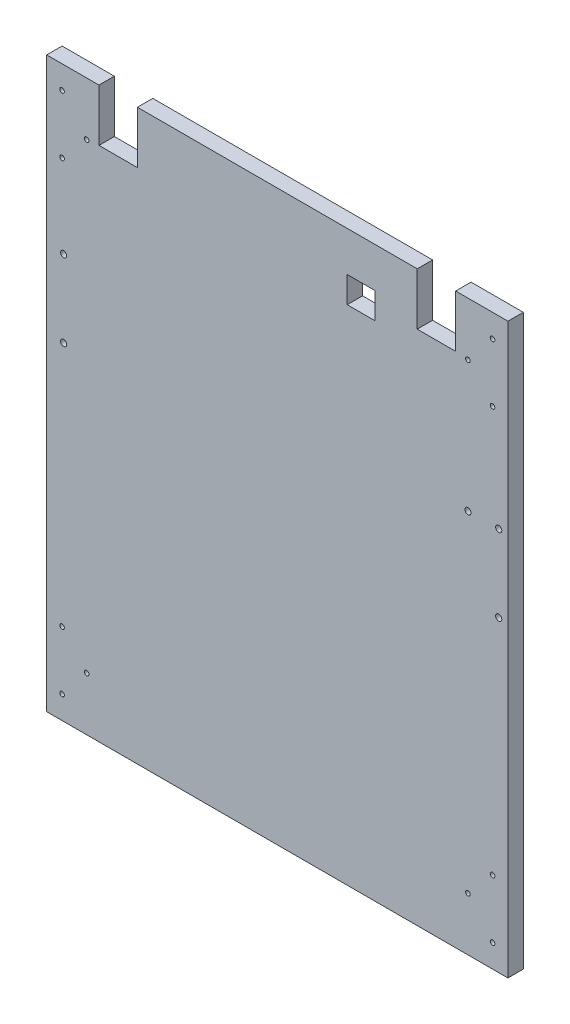
ISO-10303-21;
HEADER;
FILE_DESCRIPTION(('STEP AP214'),'2;1');
FILE_NAME('part.step','',(''),(''),'','','');
FILE_SCHEMA(('AUTOMOTIVE_DESIGN { 1 0 10303 214 1 1 1 1 }'));
ENDSEC;
DATA;
#1=APPLICATION_CONTEXT('core data for automotive mechanical design processes');
#2=APPLICATION_PROTOCOL_DEFINITION('international standard','automotive_design',2000,#1);
#3=PRODUCT_CONTEXT('',#1,'mechanical');
#4=PRODUCT('Part','Part','',(#3));
#5=PRODUCT_RELATED_PRODUCT_CATEGORY('part','',(#4));
#6=PRODUCT_DEFINITION_FORMATION('','',#4);
#7=PRODUCT_DEFINITION_CONTEXT('part definition',#1,'design');
#8=PRODUCT_DEFINITION('design','',#6,#7);
#9=PRODUCT_DEFINITION_SHAPE('','',#8);
#10=(LENGTH_UNIT() NAMED_UNIT(*) SI_UNIT(.MILLI.,.METRE.));
#11=(NAMED_UNIT(*) PLANE_ANGLE_UNIT() SI_UNIT($,.RADIAN.));
#12=(NAMED_UNIT(*) SI_UNIT($,.STERADIAN.) SOLID_ANGLE_UNIT());
#13=UNCERTAINTY_MEASURE_WITH_UNIT(LENGTH_MEASURE(1.E-05),#10,'distance_accuracy_value','');
#14=(GEOMETRIC_REPRESENTATION_CONTEXT(3) GLOBAL_UNCERTAINTY_ASSIGNED_CONTEXT((#13)) GLOBAL_UNIT_ASSIGNED_CONTEXT((#10,
#11,#12)) REPRESENTATION_CONTEXT('',''));
#15=CARTESIAN_POINT('',(0.,0.,0.));
#16=DIRECTION('',(0.,0.,1.));
#17=DIRECTION('',(1.,0.,0.));
#18=AXIS2_PLACEMENT_3D('',#15,#16,#17);
#19=CARTESIAN_POINT('',(-36.0018429702164,390.554685432822,10.));
#20=DIRECTION('',(0.,-1.,0.));
#21=DIRECTION('',(0.,0.,-1.));
#22=AXIS2_PLACEMENT_3D('',#19,#20,#21);
#23=PLANE('',#22);
#24=DIRECTION('',(-1.,0.,0.));
#25=VECTOR('',#24,1.);
#26=CARTESIAN_POINT('',(-36.0018429702164,390.554685432822,10.));
#27=LINE('',#26,#25);
#28=CARTESIAN_POINT('',(204.998157029784,390.554685432822,10.));
#29=VERTEX_POINT('',#28);
#30=CARTESIAN_POINT('',(22.9981570297836,390.554685432822,10.));
#31=VERTEX_POINT('',#30);
#32=EDGE_CURVE('E335',#29,#31,#27,.T.);
#33=ORIENTED_EDGE('',*,*,#32,.F.);
#34=DIRECTION('',(0.,0.,1.));
#35=VECTOR('',#34,1.);
#36=CARTESIAN_POINT('',(204.998157029784,390.554685432822,0.));
#37=LINE('',#36,#35);
#38=CARTESIAN_POINT('',(204.998157029784,390.554685432822,0.));
#39=VERTEX_POINT('',#38);
#40=EDGE_CURVE('E245',#39,#29,#37,.T.);
#41=ORIENTED_EDGE('',*,*,#40,.F.);
#42=DIRECTION('',(-1.,0.,0.));
#43=VECTOR('',#42,1.);
#44=CARTESIAN_POINT('',(-36.0018429702164,390.554685432822,0.));
#45=LINE('',#44,#43);
#46=CARTESIAN_POINT('',(22.9981570297836,390.554685432822,0.));
#47=VERTEX_POINT('',#46);
#48=EDGE_CURVE('E345',#39,#47,#45,.T.);
#49=ORIENTED_EDGE('',*,*,#48,.T.);
#50=DIRECTION('',(0.,0.,1.));
#51=VECTOR('',#50,1.);
#52=CARTESIAN_POINT('',(22.9981570297836,390.554685432822,0.));
#53=LINE('',#52,#51);
#54=EDGE_CURVE('E211',#47,#31,#53,.T.);
#55=ORIENTED_EDGE('',*,*,#54,.T.);
#56=EDGE_LOOP('',(#33,#41,#49,#55));
#57=FACE_BOUND('',#56,.T.);
#58=ADVANCED_FACE('F36',(#57),#23,.F.);
#59=CARTESIAN_POINT('',(263.998157029784,390.554685432822,0.));
#60=VERTEX_POINT('',#59);
#61=CARTESIAN_POINT('',(229.998157029784,390.554685432822,0.));
#62=VERTEX_POINT('',#61);
#63=EDGE_CURVE('E326',#60,#62,#45,.T.);
#64=ORIENTED_EDGE('',*,*,#63,.T.);
#65=DIRECTION('',(0.,0.,1.));
#66=VECTOR('',#65,1.);
#67=CARTESIAN_POINT('',(229.998157029784,390.554685432822,0.));
#68=LINE('',#67,#66);
#69=CARTESIAN_POINT('',(229.998157029784,390.554685432822,10.));
#70=VERTEX_POINT('',#69);
#71=EDGE_CURVE('E262',#62,#70,#68,.T.);
#72=ORIENTED_EDGE('',*,*,#71,.T.);
#73=CARTESIAN_POINT('',(263.998157029784,390.554685432822,10.));
#74=VERTEX_POINT('',#73);
#75=EDGE_CURVE('E331',#74,#70,#27,.T.);
#76=ORIENTED_EDGE('',*,*,#75,.F.);
#77=DIRECTION('',(0.,0.,-1.));
#78=VECTOR('',#77,1.);
#79=CARTESIAN_POINT('',(263.998157029784,390.554685432822,10.));
#80=LINE('',#79,#78);
#81=EDGE_CURVE('E348',#74,#60,#80,.T.);
#82=ORIENTED_EDGE('',*,*,#81,.T.);
#83=EDGE_LOOP('',(#64,#72,#76,#82));
#84=FACE_BOUND('',#83,.T.);
#85=ADVANCED_FACE('F363',(#84),#23,.F.);
#86=CARTESIAN_POINT('',(-36.0018429702164,390.554685432822,10.));
#87=DIRECTION('',(1.,0.,0.));
#88=DIRECTION('',(0.,1.,0.));
#89=AXIS2_PLACEMENT_3D('',#86,#87,#88);
#90=PLANE('',#89);
#91=DIRECTION('',(0.,-1.,0.));
#92=VECTOR('',#91,1.);
#93=CARTESIAN_POINT('',(-36.0018429702164,390.554685432822,0.));
#94=LINE('',#93,#92);
#95=CARTESIAN_POINT('',(-36.0018429702164,390.554685432822,0.));
#96=VERTEX_POINT('',#95);
#97=CARTESIAN_POINT('',(-36.0018429702163,20.5546854328225,0.));
#98=VERTEX_POINT('',#97);
#99=EDGE_CURVE('E319',#96,#98,#94,.T.);
#100=ORIENTED_EDGE('',*,*,#99,.T.);
#101=DIRECTION('',(0.,0.,-1.));
#102=VECTOR('',#101,1.);
#103=CARTESIAN_POINT('',(-36.0018429702163,20.5546854328225,10.));
#104=LINE('',#103,#102);
#105=CARTESIAN_POINT('',(-36.0018429702163,20.5546854328225,10.));
#106=VERTEX_POINT('',#105);
#107=EDGE_CURVE('E11',#106,#98,#104,.T.);
#108=ORIENTED_EDGE('',*,*,#107,.F.);
#109=DIRECTION('',(0.,-1.,0.));
#110=VECTOR('',#109,1.);
#111=CARTESIAN_POINT('',(-36.0018429702164,390.554685432822,10.));
#112=LINE('',#111,#110);
#113=CARTESIAN_POINT('',(-36.0018429702164,390.554685432822,10.));
#114=VERTEX_POINT('',#113);
#115=EDGE_CURVE('E322',#114,#106,#112,.T.);
#116=ORIENTED_EDGE('',*,*,#115,.F.);
#117=DIRECTION('',(0.,0.,-1.));
#118=VECTOR('',#117,1.);
#119=CARTESIAN_POINT('',(-36.0018429702164,390.554685432822,10.));
#120=LINE('',#119,#118);
#121=EDGE_CURVE('E334',#114,#96,#120,.T.);
#122=ORIENTED_EDGE('',*,*,#121,.T.);
#123=EDGE_LOOP('',(#100,#108,#116,#122));
#124=FACE_BOUND('',#123,.T.);
#125=ADVANCED_FACE('F38',(#124),#90,.F.);
#126=CARTESIAN_POINT('',(-36.0018429702163,20.5546854328225,10.));
#127=DIRECTION('',(0.,1.,0.));
#128=DIRECTION('',(0.,0.,1.));
#129=AXIS2_PLACEMENT_3D('',#126,#127,#128);
#130=PLANE('',#129);
#131=DIRECTION('',(1.,0.,0.));
#132=VECTOR('',#131,1.);
#133=CARTESIAN_POINT('',(-36.0018429702163,20.5546854328225,0.));
#134=LINE('',#133,#132);
#135=CARTESIAN_POINT('',(263.998157029784,20.5546854328225,0.));
#136=VERTEX_POINT('',#135);
#137=EDGE_CURVE('E338',#98,#136,#134,.T.);
#138=ORIENTED_EDGE('',*,*,#137,.T.);
#139=DIRECTION('',(0.,0.,-1.));
#140=VECTOR('',#139,1.);
#141=CARTESIAN_POINT('',(263.998157029784,20.5546854328225,10.));
#142=LINE('',#141,#140);
#143=CARTESIAN_POINT('',(263.998157029784,20.5546854328225,10.));
#144=VERTEX_POINT('',#143);
#145=EDGE_CURVE('E44',#144,#136,#142,.T.);
#146=ORIENTED_EDGE('',*,*,#145,.F.);
#147=DIRECTION('',(1.,0.,0.));
#148=VECTOR('',#147,1.);
#149=CARTESIAN_POINT('',(-36.0018429702163,20.5546854328225,10.));
#150=LINE('',#149,#148);
#151=EDGE_CURVE('E325',#106,#144,#150,.T.);
#152=ORIENTED_EDGE('',*,*,#151,.F.);
#153=ORIENTED_EDGE('',*,*,#107,.T.);
#154=EDGE_LOOP('',(#138,#146,#152,#153));
#155=FACE_BOUND('',#154,.T.);
#156=ADVANCED_FACE('F373',(#155),#130,.F.);
#157=CARTESIAN_POINT('',(263.998157029784,390.554685432822,10.));
#158=DIRECTION('',(-1.,0.,0.));
#159=DIRECTION('',(0.,-1.,0.));
#160=AXIS2_PLACEMENT_3D('',#157,#158,#159);
#161=PLANE('',#160);
#162=DIRECTION('',(0.,1.,0.));
#163=VECTOR('',#162,1.);
#164=CARTESIAN_POINT('',(263.998157029784,390.554685432822,0.));
#165=LINE('',#164,#163);
#166=EDGE_CURVE('E340',#136,#60,#165,.T.);
#167=ORIENTED_EDGE('',*,*,#166,.T.);
#168=ORIENTED_EDGE('',*,*,#81,.F.);
#169=DIRECTION('',(0.,1.,0.));
#170=VECTOR('',#169,1.);
#171=CARTESIAN_POINT('',(263.998157029784,390.554685432822,10.));
#172=LINE('',#171,#170);
#173=EDGE_CURVE('E328',#144,#74,#172,.T.);
#174=ORIENTED_EDGE('',*,*,#173,.F.);
#175=ORIENTED_EDGE('',*,*,#145,.T.);
#176=EDGE_LOOP('',(#167,#168,#174,#175));
#177=FACE_BOUND('',#176,.T.);
#178=ADVANCED_FACE('F355',(#177),#161,.F.);
#179=CARTESIAN_POINT('',(-2.00184297021636,390.554685432822,10.));
#180=VERTEX_POINT('',#179);
#181=EDGE_CURVE('E330',#180,#114,#27,.T.);
#182=ORIENTED_EDGE('',*,*,#181,.F.);
#183=DIRECTION('',(0.,0.,1.));
#184=VECTOR('',#183,1.);
#185=CARTESIAN_POINT('',(-2.00184297021636,390.554685432822,0.));
#186=LINE('',#185,#184);
#187=CARTESIAN_POINT('',(-2.00184297021636,390.554685432822,0.));
#188=VERTEX_POINT('',#187);
#189=EDGE_CURVE('E202',#188,#180,#186,.T.);
#190=ORIENTED_EDGE('',*,*,#189,.F.);
#191=EDGE_CURVE('E342',#188,#96,#45,.T.);
#192=ORIENTED_EDGE('',*,*,#191,.T.);
#193=ORIENTED_EDGE('',*,*,#121,.F.);
#194=EDGE_LOOP('',(#182,#190,#192,#193));
#195=FACE_BOUND('',#194,.T.);
#196=ADVANCED_FACE('F391',(#195),#23,.F.);
#197=CARTESIAN_POINT('',(0.,0.,10.));
#198=DIRECTION('',(0.,0.,1.));
#199=DIRECTION('',(1.,0.,0.));
#200=AXIS2_PLACEMENT_3D('',#197,#198,#199);
#201=PLANE('',#200);
#202=CARTESIAN_POINT('',(-10.0018429702163,355.804685432822,10.));
#203=DIRECTION('',(0.,0.,1.));
#204=DIRECTION('',(-1.,0.,0.));
#205=AXIS2_PLACEMENT_3D('',#202,#203,#204);
#206=CIRCLE('',#205,1.5);
#207=CARTESIAN_POINT('',(-11.5018429702163,355.804685432822,10.));
#208=VERTEX_POINT('',#207);
#209=EDGE_CURVE('E230',#208,#208,#206,.T.);
#210=ORIENTED_EDGE('',*,*,#209,.F.);
#211=EDGE_LOOP('',(#210));
#212=FACE_BOUND('',#211,.T.);
#213=CARTESIAN_POINT('',(-10.0018429702163,55.3046854328224,10.));
#214=DIRECTION('',(0.,0.,1.));
#215=DIRECTION('',(1.,0.,0.));
#216=AXIS2_PLACEMENT_3D('',#213,#214,#215);
#217=CIRCLE('',#216,1.5);
#218=CARTESIAN_POINT('',(-8.5018429702163,55.3046854328224,10.));
#219=VERTEX_POINT('',#218);
#220=EDGE_CURVE('E236',#219,#219,#217,.T.);
#221=ORIENTED_EDGE('',*,*,#220,.F.);
#222=EDGE_LOOP('',(#221));
#223=FACE_BOUND('',#222,.T.);
#224=CARTESIAN_POINT('',(237.998157029784,55.3046854328224,10.));
#225=DIRECTION('',(0.,0.,1.));
#226=DIRECTION('',(-1.,0.,0.));
#227=AXIS2_PLACEMENT_3D('',#224,#225,#226);
#228=CIRCLE('',#227,1.5);
#229=CARTESIAN_POINT('',(236.498157029784,55.3046854328224,10.));
#230=VERTEX_POINT('',#229);
#231=EDGE_CURVE('E242',#230,#230,#228,.T.);
#232=ORIENTED_EDGE('',*,*,#231,.F.);
#233=EDGE_LOOP('',(#232));
#234=FACE_BOUND('',#233,.T.);
#235=DIRECTION('',(0.,-1.,0.));
#236=VECTOR('',#235,1.);
#237=CARTESIAN_POINT('',(204.998157029784,356.554685432822,10.));
#238=LINE('',#237,#236);
#239=CARTESIAN_POINT('',(204.998157029784,356.554685432822,10.));
#240=VERTEX_POINT('',#239);
#241=EDGE_CURVE('E214',#29,#240,#238,.T.);
#242=ORIENTED_EDGE('',*,*,#241,.F.);
#243=ORIENTED_EDGE('',*,*,#32,.T.);
#244=DIRECTION('',(0.,1.,0.));
#245=VECTOR('',#244,1.);
#246=CARTESIAN_POINT('',(22.9981570297836,356.554685432822,10.));
#247=LINE('',#246,#245);
#248=CARTESIAN_POINT('',(22.9981570297836,356.554685432822,10.));
#249=VERTEX_POINT('',#248);
#250=EDGE_CURVE('E196',#249,#31,#247,.T.);
#251=ORIENTED_EDGE('',*,*,#250,.F.);
#252=DIRECTION('',(1.,0.,0.));
#253=VECTOR('',#252,1.);
#254=CARTESIAN_POINT('',(-2.00184297021636,356.554685432822,10.));
#255=LINE('',#254,#253);
#256=CARTESIAN_POINT('',(-2.00184297021636,356.554685432822,10.));
#257=VERTEX_POINT('',#256);
#258=EDGE_CURVE('E206',#257,#249,#255,.T.);
#259=ORIENTED_EDGE('',*,*,#258,.F.);
#260=DIRECTION('',(0.,-1.,0.));
#261=VECTOR('',#260,1.);
#262=CARTESIAN_POINT('',(-2.00184297021636,390.554685432822,10.));
#263=LINE('',#262,#261);
#264=EDGE_CURVE('E203',#180,#257,#263,.T.);
#265=ORIENTED_EDGE('',*,*,#264,.F.);
#266=ORIENTED_EDGE('',*,*,#181,.T.);
#267=ORIENTED_EDGE('',*,*,#115,.T.);
#268=ORIENTED_EDGE('',*,*,#151,.T.);
#269=ORIENTED_EDGE('',*,*,#173,.T.);
#270=ORIENTED_EDGE('',*,*,#75,.T.);
#271=DIRECTION('',(0.,1.,0.));
#272=VECTOR('',#271,1.);
#273=CARTESIAN_POINT('',(229.998157029784,390.554685432822,10.));
#274=LINE('',#273,#272);
#275=CARTESIAN_POINT('',(229.998157029784,356.554685432822,10.));
#276=VERTEX_POINT('',#275);
#277=EDGE_CURVE('E250',#276,#70,#274,.T.);
#278=ORIENTED_EDGE('',*,*,#277,.F.);
#279=DIRECTION('',(1.,0.,0.));
#280=VECTOR('',#279,1.);
#281=CARTESIAN_POINT('',(229.998157029784,356.554685432822,10.));
#282=LINE('',#281,#280);
#283=EDGE_CURVE('E257',#240,#276,#282,.T.);
#284=ORIENTED_EDGE('',*,*,#283,.F.);
#285=EDGE_LOOP('',(#242,#243,#251,#259,#265,#266,#267,#268,#269,#270,#278,#284));
#286=FACE_BOUND('',#285,.T.);
#287=DIRECTION('',(0.,-1.,0.));
#288=VECTOR('',#287,1.);
#289=CARTESIAN_POINT('',(159.455584524281,355.554685432822,10.));
#290=LINE('',#289,#288);
#291=CARTESIAN_POINT('',(159.455584524281,364.554685432822,10.));
#292=VERTEX_POINT('',#291);
#293=CARTESIAN_POINT('',(159.455584524281,347.554685432822,10.));
#294=VERTEX_POINT('',#293);
#295=EDGE_CURVE('E153',#292,#294,#290,.T.);
#296=ORIENTED_EDGE('',*,*,#295,.F.);
#297=DIRECTION('',(-1.,0.,0.));
#298=VECTOR('',#297,1.);
#299=CARTESIAN_POINT('',(159.455584524281,364.554685432822,10.));
#300=LINE('',#299,#298);
#301=CARTESIAN_POINT('',(177.455584524281,364.554685432822,10.));
#302=VERTEX_POINT('',#301);
#303=EDGE_CURVE('E171',#302,#292,#300,.T.);
#304=ORIENTED_EDGE('',*,*,#303,.F.);
#305=DIRECTION('',(0.,1.,0.));
#306=VECTOR('',#305,1.);
#307=CARTESIAN_POINT('',(177.455584524281,364.554685432822,10.));
#308=LINE('',#307,#306);
#309=CARTESIAN_POINT('',(177.455584524281,347.554685432822,10.));
#310=VERTEX_POINT('',#309);
#311=EDGE_CURVE('E181',#310,#302,#308,.T.);
#312=ORIENTED_EDGE('',*,*,#311,.F.);
#313=DIRECTION('',(1.,0.,0.));
#314=VECTOR('',#313,1.);
#315=CARTESIAN_POINT('',(177.455584524281,347.554685432822,10.));
#316=LINE('',#315,#314);
#317=EDGE_CURVE('E179',#294,#310,#316,.T.);
#318=ORIENTED_EDGE('',*,*,#317,.F.);
#319=EDGE_LOOP('',(#296,#304,#312,#318));
#320=FACE_BOUND('',#319,.T.);
#321=CARTESIAN_POINT('',(257.998157029784,270.554685432822,10.));
#322=DIRECTION('',(0.,0.,1.));
#323=DIRECTION('',(1.,0.,0.));
#324=AXIS2_PLACEMENT_3D('',#321,#322,#323);
#325=CIRCLE('',#324,2.);
#326=CARTESIAN_POINT('',(259.998157029784,270.554685432822,10.));
#327=VERTEX_POINT('',#326);
#328=EDGE_CURVE('E174',#327,#327,#325,.T.);
#329=ORIENTED_EDGE('',*,*,#328,.F.);
#330=EDGE_LOOP('',(#329));
#331=FACE_BOUND('',#330,.T.);
#332=CARTESIAN_POINT('',(237.998157029784,270.554685432822,10.));
#333=DIRECTION('',(0.,0.,1.));
#334=DIRECTION('',(1.,0.,0.));
#335=AXIS2_PLACEMENT_3D('',#332,#333,#334);
#336=CIRCLE('',#335,2.);
#337=CARTESIAN_POINT('',(239.998157029784,270.554685432822,10.));
#338=VERTEX_POINT('',#337);
#339=EDGE_CURVE('E222',#338,#338,#336,.T.);
#340=ORIENTED_EDGE('',*,*,#339,.F.);
#341=EDGE_LOOP('',(#340));
#342=FACE_BOUND('',#341,.T.);
#343=CARTESIAN_POINT('',(-26.0018429702163,35.5546854328225,10.));
#344=DIRECTION('',(0.,0.,1.));
#345=DIRECTION('',(1.,0.,0.));
#346=AXIS2_PLACEMENT_3D('',#343,#344,#345);
#347=CIRCLE('',#346,1.49999999999997);
#348=CARTESIAN_POINT('',(-24.5018429702163,35.5546854328225,10.));
#349=VERTEX_POINT('',#348);
#350=EDGE_CURVE('E283',#349,#349,#347,.T.);
#351=ORIENTED_EDGE('',*,*,#350,.F.);
#352=EDGE_LOOP('',(#351));
#353=FACE_BOUND('',#352,.T.);
#354=CARTESIAN_POINT('',(-26.0018429702163,375.554685432822,10.));
#355=DIRECTION('',(0.,0.,1.));
#356=DIRECTION('',(-1.,0.,0.));
#357=AXIS2_PLACEMENT_3D('',#354,#355,#356);
#358=CIRCLE('',#357,1.49999999999997);
#359=CARTESIAN_POINT('',(-27.5018429702163,375.554685432822,10.));
#360=VERTEX_POINT('',#359);
#361=EDGE_CURVE('E296',#360,#360,#358,.T.);
#362=ORIENTED_EDGE('',*,*,#361,.F.);
#363=EDGE_LOOP('',(#362));
#364=FACE_BOUND('',#363,.T.);
#365=CARTESIAN_POINT('',(-26.0018429702163,337.554685432822,10.));
#366=DIRECTION('',(0.,0.,1.));
#367=DIRECTION('',(-1.,0.,0.));
#368=AXIS2_PLACEMENT_3D('',#365,#366,#367);
#369=CIRCLE('',#368,1.49999999999997);
#370=CARTESIAN_POINT('',(-27.5018429702163,337.554685432822,10.));
#371=VERTEX_POINT('',#370);
#372=EDGE_CURVE('E295',#371,#371,#369,.T.);
#373=ORIENTED_EDGE('',*,*,#372,.F.);
#374=EDGE_LOOP('',(#373));
#375=FACE_BOUND('',#374,.T.);
#376=CARTESIAN_POINT('',(253.998157029784,337.554685432822,10.));
#377=DIRECTION('',(0.,0.,1.));
#378=DIRECTION('',(1.,0.,0.));
#379=AXIS2_PLACEMENT_3D('',#376,#377,#378);
#380=CIRCLE('',#379,1.49999999999997);
#381=CARTESIAN_POINT('',(255.498157029784,337.554685432822,10.));
#382=VERTEX_POINT('',#381);
#383=EDGE_CURVE('E308',#382,#382,#380,.T.);
#384=ORIENTED_EDGE('',*,*,#383,.F.);
#385=EDGE_LOOP('',(#384));
#386=FACE_BOUND('',#385,.T.);
#387=CARTESIAN_POINT('',(237.998157029784,355.804685432823,10.));
#388=DIRECTION('',(0.,0.,1.));
#389=DIRECTION('',(1.,0.,0.));
#390=AXIS2_PLACEMENT_3D('',#387,#388,#389);
#391=CIRCLE('',#390,1.5);
#392=CARTESIAN_POINT('',(239.498157029784,355.804685432823,10.));
#393=VERTEX_POINT('',#392);
#394=EDGE_CURVE('E229',#393,#393,#391,.T.);
#395=ORIENTED_EDGE('',*,*,#394,.F.);
#396=EDGE_LOOP('',(#395));
#397=FACE_BOUND('',#396,.T.);
#398=CARTESIAN_POINT('',(253.998157029784,35.5546854328225,10.));
#399=DIRECTION('',(0.,0.,1.));
#400=DIRECTION('',(-1.,0.,0.));
#401=AXIS2_PLACEMENT_3D('',#398,#399,#400);
#402=CIRCLE('',#401,1.49999999999997);
#403=CARTESIAN_POINT('',(252.498157029784,35.5546854328225,10.));
#404=VERTEX_POINT('',#403);
#405=EDGE_CURVE('E272',#404,#404,#402,.T.);
#406=ORIENTED_EDGE('',*,*,#405,.F.);
#407=EDGE_LOOP('',(#406));
#408=FACE_BOUND('',#407,.T.);
#409=CARTESIAN_POINT('',(253.998157029784,73.5546854328225,10.));
#410=DIRECTION('',(0.,0.,1.));
#411=DIRECTION('',(-1.,0.,0.));
#412=AXIS2_PLACEMENT_3D('',#409,#410,#411);
#413=CIRCLE('',#412,1.49999999999997);
#414=CARTESIAN_POINT('',(252.498157029784,73.5546854328225,10.));
#415=VERTEX_POINT('',#414);
#416=EDGE_CURVE('E271',#415,#415,#413,.T.);
#417=ORIENTED_EDGE('',*,*,#416,.F.);
#418=EDGE_LOOP('',(#417));
#419=FACE_BOUND('',#418,.T.);
#420=CARTESIAN_POINT('',(-26.0018429702163,73.5546854328225,10.));
#421=DIRECTION('',(0.,0.,1.));
#422=DIRECTION('',(1.,0.,0.));
#423=AXIS2_PLACEMENT_3D('',#420,#421,#422);
#424=CIRCLE('',#423,1.49999999999997);
#425=CARTESIAN_POINT('',(-24.5018429702163,73.5546854328225,10.));
#426=VERTEX_POINT('',#425);
#427=EDGE_CURVE('E284',#426,#426,#424,.T.);
#428=ORIENTED_EDGE('',*,*,#427,.F.);
#429=EDGE_LOOP('',(#428));
#430=FACE_BOUND('',#429,.T.);
#431=CARTESIAN_POINT('',(257.998157029784,220.554685432822,10.));
#432=DIRECTION('',(0.,0.,1.));
#433=DIRECTION('',(1.,0.,0.));
#434=AXIS2_PLACEMENT_3D('',#431,#432,#433);
#435=CIRCLE('',#434,2.);
#436=CARTESIAN_POINT('',(259.998157029784,220.554685432822,10.));
#437=VERTEX_POINT('',#436);
#438=EDGE_CURVE('E757',#437,#437,#435,.T.);
#439=ORIENTED_EDGE('',*,*,#438,.F.);
#440=EDGE_LOOP('',(#439));
#441=FACE_BOUND('',#440,.T.);
#442=CARTESIAN_POINT('',(-24.9801371215423,233.808013479632,10.));
#443=DIRECTION('',(0.,0.,1.));
#444=DIRECTION('',(1.,0.,0.));
#445=AXIS2_PLACEMENT_3D('',#442,#443,#444);
#446=CIRCLE('',#445,2.);
#447=CARTESIAN_POINT('',(-22.9801371215423,233.808013479632,10.));
#448=VERTEX_POINT('',#447);
#449=EDGE_CURVE('E761',#448,#448,#446,.T.);
#450=ORIENTED_EDGE('',*,*,#449,.F.);
#451=EDGE_LOOP('',(#450));
#452=FACE_BOUND('',#451,.T.);
#453=CARTESIAN_POINT('',(-24.9801371215423,283.808013479632,10.));
#454=DIRECTION('',(0.,0.,1.));
#455=DIRECTION('',(1.,0.,0.));
#456=AXIS2_PLACEMENT_3D('',#453,#454,#455);
#457=CIRCLE('',#456,1.99999999999999);
#458=CARTESIAN_POINT('',(-22.9801371215424,283.808013479632,10.));
#459=VERTEX_POINT('',#458);
#460=EDGE_CURVE('E765',#459,#459,#457,.T.);
#461=ORIENTED_EDGE('',*,*,#460,.F.);
#462=EDGE_LOOP('',(#461));
#463=FACE_BOUND('',#462,.T.);
#464=CARTESIAN_POINT('',(253.998157029784,375.554685432822,10.));
#465=DIRECTION('',(0.,0.,1.));
#466=DIRECTION('',(1.,0.,0.));
#467=AXIS2_PLACEMENT_3D('',#464,#465,#466);
#468=CIRCLE('',#467,1.49999999999997);
#469=CARTESIAN_POINT('',(255.498157029784,375.554685432822,10.));
#470=VERTEX_POINT('',#469);
#471=EDGE_CURVE('E307',#470,#470,#468,.T.);
#472=ORIENTED_EDGE('',*,*,#471,.F.);
#473=EDGE_LOOP('',(#472));
#474=FACE_BOUND('',#473,.T.);
#475=ADVANCED_FACE('F368',(#212,#223,#234,#286,#320,#331,#342,#353,#364,#375,#386,#397,#408,
#419,#430,#441,#452,#463,#474),#201,.T.);
#476=CARTESIAN_POINT('',(0.,0.,0.));
#477=DIRECTION('',(0.,0.,1.));
#478=DIRECTION('',(1.,0.,0.));
#479=AXIS2_PLACEMENT_3D('',#476,#477,#478);
#480=PLANE('',#479);
#481=CARTESIAN_POINT('',(-10.0018429702163,355.804685432822,0.));
#482=DIRECTION('',(0.,0.,1.));
#483=DIRECTION('',(-1.,0.,0.));
#484=AXIS2_PLACEMENT_3D('',#481,#482,#483);
#485=CIRCLE('',#484,1.5);
#486=CARTESIAN_POINT('',(-11.5018429702163,355.804685432822,0.));
#487=VERTEX_POINT('',#486);
#488=EDGE_CURVE('E226',#487,#487,#485,.T.);
#489=ORIENTED_EDGE('',*,*,#488,.T.);
#490=EDGE_LOOP('',(#489));
#491=FACE_BOUND('',#490,.T.);
#492=CARTESIAN_POINT('',(-10.0018429702163,55.3046854328224,0.));
#493=DIRECTION('',(0.,0.,1.));
#494=DIRECTION('',(1.,0.,0.));
#495=AXIS2_PLACEMENT_3D('',#492,#493,#494);
#496=CIRCLE('',#495,1.5);
#497=CARTESIAN_POINT('',(-8.5018429702163,55.3046854328224,0.));
#498=VERTEX_POINT('',#497);
#499=EDGE_CURVE('E233',#498,#498,#496,.T.);
#500=ORIENTED_EDGE('',*,*,#499,.T.);
#501=EDGE_LOOP('',(#500));
#502=FACE_BOUND('',#501,.T.);
#503=CARTESIAN_POINT('',(237.998157029784,55.3046854328224,0.));
#504=DIRECTION('',(0.,0.,1.));
#505=DIRECTION('',(-1.,0.,0.));
#506=AXIS2_PLACEMENT_3D('',#503,#504,#505);
#507=CIRCLE('',#506,1.5);
#508=CARTESIAN_POINT('',(236.498157029784,55.3046854328224,0.));
#509=VERTEX_POINT('',#508);
#510=EDGE_CURVE('E239',#509,#509,#507,.T.);
#511=ORIENTED_EDGE('',*,*,#510,.T.);
#512=EDGE_LOOP('',(#511));
#513=FACE_BOUND('',#512,.T.);
#514=ORIENTED_EDGE('',*,*,#48,.F.);
#515=DIRECTION('',(0.,-1.,0.));
#516=VECTOR('',#515,1.);
#517=CARTESIAN_POINT('',(204.998157029784,356.554685432822,0.));
#518=LINE('',#517,#516);
#519=CARTESIAN_POINT('',(204.998157029784,356.554685432822,0.));
#520=VERTEX_POINT('',#519);
#521=EDGE_CURVE('E246',#39,#520,#518,.T.);
#522=ORIENTED_EDGE('',*,*,#521,.T.);
#523=DIRECTION('',(1.,0.,0.));
#524=VECTOR('',#523,1.);
#525=CARTESIAN_POINT('',(229.998157029784,356.554685432822,0.));
#526=LINE('',#525,#524);
#527=CARTESIAN_POINT('',(229.998157029784,356.554685432822,0.));
#528=VERTEX_POINT('',#527);
#529=EDGE_CURVE('E249',#520,#528,#526,.T.);
#530=ORIENTED_EDGE('',*,*,#529,.T.);
#531=DIRECTION('',(0.,1.,0.));
#532=VECTOR('',#531,1.);
#533=CARTESIAN_POINT('',(229.998157029784,390.554685432822,0.));
#534=LINE('',#533,#532);
#535=EDGE_CURVE('E59',#528,#62,#534,.T.);
#536=ORIENTED_EDGE('',*,*,#535,.T.);
#537=ORIENTED_EDGE('',*,*,#63,.F.);
#538=ORIENTED_EDGE('',*,*,#166,.F.);
#539=ORIENTED_EDGE('',*,*,#137,.F.);
#540=ORIENTED_EDGE('',*,*,#99,.F.);
#541=ORIENTED_EDGE('',*,*,#191,.F.);
#542=DIRECTION('',(0.,-1.,0.));
#543=VECTOR('',#542,1.);
#544=CARTESIAN_POINT('',(-2.00184297021636,390.554685432822,0.));
#545=LINE('',#544,#543);
#546=CARTESIAN_POINT('',(-2.00184297021636,356.554685432822,0.));
#547=VERTEX_POINT('',#546);
#548=EDGE_CURVE('E192',#188,#547,#545,.T.);
#549=ORIENTED_EDGE('',*,*,#548,.T.);
#550=DIRECTION('',(1.,0.,0.));
#551=VECTOR('',#550,1.);
#552=CARTESIAN_POINT('',(-2.00184297021636,356.554685432822,0.));
#553=LINE('',#552,#551);
#554=CARTESIAN_POINT('',(22.9981570297836,356.554685432822,0.));
#555=VERTEX_POINT('',#554);
#556=EDGE_CURVE('E195',#547,#555,#553,.T.);
#557=ORIENTED_EDGE('',*,*,#556,.T.);
#558=DIRECTION('',(0.,1.,0.));
#559=VECTOR('',#558,1.);
#560=CARTESIAN_POINT('',(22.9981570297836,356.554685432822,0.));
#561=LINE('',#560,#559);
#562=EDGE_CURVE('E199',#555,#47,#561,.T.);
#563=ORIENTED_EDGE('',*,*,#562,.T.);
#564=EDGE_LOOP('',(#514,#522,#530,#536,#537,#538,#539,#540,#541,#549,#557,#563));
#565=FACE_BOUND('',#564,.T.);
#566=DIRECTION('',(-1.,0.,0.));
#567=VECTOR('',#566,1.);
#568=CARTESIAN_POINT('',(159.455584524281,364.554685432822,0.));
#569=LINE('',#568,#567);
#570=CARTESIAN_POINT('',(177.455584524281,364.554685432822,0.));
#571=VERTEX_POINT('',#570);
#572=CARTESIAN_POINT('',(159.455584524281,364.554685432822,0.));
#573=VERTEX_POINT('',#572);
#574=EDGE_CURVE('E156',#571,#573,#569,.T.);
#575=ORIENTED_EDGE('',*,*,#574,.T.);
#576=DIRECTION('',(0.,-1.,0.));
#577=VECTOR('',#576,1.);
#578=CARTESIAN_POINT('',(159.455584524281,347.554685432822,0.));
#579=LINE('',#578,#577);
#580=CARTESIAN_POINT('',(159.455584524281,347.554685432822,0.));
#581=VERTEX_POINT('',#580);
#582=EDGE_CURVE('E150',#573,#581,#579,.T.);
#583=ORIENTED_EDGE('',*,*,#582,.T.);
#584=DIRECTION('',(1.,0.,0.));
#585=VECTOR('',#584,1.);
#586=CARTESIAN_POINT('',(177.455584524281,347.554685432822,0.));
#587=LINE('',#586,#585);
#588=CARTESIAN_POINT('',(177.455584524281,347.554685432822,0.));
#589=VERTEX_POINT('',#588);
#590=EDGE_CURVE('E160',#581,#589,#587,.T.);
#591=ORIENTED_EDGE('',*,*,#590,.T.);
#592=DIRECTION('',(0.,1.,0.));
#593=VECTOR('',#592,1.);
#594=CARTESIAN_POINT('',(177.455584524281,356.554685432822,0.));
#595=LINE('',#594,#593);
#596=EDGE_CURVE('E164',#589,#571,#595,.T.);
#597=ORIENTED_EDGE('',*,*,#596,.T.);
#598=EDGE_LOOP('',(#575,#583,#591,#597));
#599=FACE_BOUND('',#598,.T.);
#600=CARTESIAN_POINT('',(257.998157029784,270.554685432822,0.));
#601=DIRECTION('',(0.,0.,1.));
#602=DIRECTION('',(1.,0.,0.));
#603=AXIS2_PLACEMENT_3D('',#600,#601,#602);
#604=CIRCLE('',#603,2.);
#605=CARTESIAN_POINT('',(259.998157029784,270.554685432822,0.));
#606=VERTEX_POINT('',#605);
#607=EDGE_CURVE('E225',#606,#606,#604,.T.);
#608=ORIENTED_EDGE('',*,*,#607,.T.);
#609=EDGE_LOOP('',(#608));
#610=FACE_BOUND('',#609,.T.);
#611=CARTESIAN_POINT('',(237.998157029784,270.554685432822,0.));
#612=DIRECTION('',(0.,0.,1.));
#613=DIRECTION('',(1.,0.,0.));
#614=AXIS2_PLACEMENT_3D('',#611,#612,#613);
#615=CIRCLE('',#614,2.);
#616=CARTESIAN_POINT('',(239.998157029784,270.554685432822,0.));
#617=VERTEX_POINT('',#616);
#618=EDGE_CURVE('E207',#617,#617,#615,.T.);
#619=ORIENTED_EDGE('',*,*,#618,.T.);
#620=EDGE_LOOP('',(#619));
#621=FACE_BOUND('',#620,.T.);
#622=CARTESIAN_POINT('',(-26.0018429702163,35.5546854328225,0.));
#623=DIRECTION('',(0.,0.,1.));
#624=DIRECTION('',(1.,0.,0.));
#625=AXIS2_PLACEMENT_3D('',#622,#623,#624);
#626=CIRCLE('',#625,1.49999999999997);
#627=CARTESIAN_POINT('',(-24.5018429702163,35.5546854328225,0.));
#628=VERTEX_POINT('',#627);
#629=EDGE_CURVE('E299',#628,#628,#626,.T.);
#630=ORIENTED_EDGE('',*,*,#629,.T.);
#631=EDGE_LOOP('',(#630));
#632=FACE_BOUND('',#631,.T.);
#633=CARTESIAN_POINT('',(-26.0018429702163,375.554685432822,0.));
#634=DIRECTION('',(0.,0.,1.));
#635=DIRECTION('',(-1.,0.,0.));
#636=AXIS2_PLACEMENT_3D('',#633,#634,#635);
#637=CIRCLE('',#636,1.49999999999997);
#638=CARTESIAN_POINT('',(-27.5018429702163,375.554685432822,0.));
#639=VERTEX_POINT('',#638);
#640=EDGE_CURVE('E292',#639,#639,#637,.T.);
#641=ORIENTED_EDGE('',*,*,#640,.T.);
#642=EDGE_LOOP('',(#641));
#643=FACE_BOUND('',#642,.T.);
#644=CARTESIAN_POINT('',(-26.0018429702163,337.554685432822,0.));
#645=DIRECTION('',(0.,0.,1.));
#646=DIRECTION('',(-1.,0.,0.));
#647=AXIS2_PLACEMENT_3D('',#644,#645,#646);
#648=CIRCLE('',#647,1.49999999999997);
#649=CARTESIAN_POINT('',(-27.5018429702163,337.554685432822,0.));
#650=VERTEX_POINT('',#649);
#651=EDGE_CURVE('E311',#650,#650,#648,.T.);
#652=ORIENTED_EDGE('',*,*,#651,.T.);
#653=EDGE_LOOP('',(#652));
#654=FACE_BOUND('',#653,.T.);
#655=CARTESIAN_POINT('',(253.998157029784,337.554685432822,0.));
#656=DIRECTION('',(0.,0.,1.));
#657=DIRECTION('',(1.,0.,0.));
#658=AXIS2_PLACEMENT_3D('',#655,#656,#657);
#659=CIRCLE('',#658,1.49999999999997);
#660=CARTESIAN_POINT('',(255.498157029784,337.554685432822,0.));
#661=VERTEX_POINT('',#660);
#662=EDGE_CURVE('E304',#661,#661,#659,.T.);
#663=ORIENTED_EDGE('',*,*,#662,.T.);
#664=EDGE_LOOP('',(#663));
#665=FACE_BOUND('',#664,.T.);
#666=CARTESIAN_POINT('',(237.998157029784,355.804685432823,0.));
#667=DIRECTION('',(0.,0.,1.));
#668=DIRECTION('',(1.,0.,0.));
#669=AXIS2_PLACEMENT_3D('',#666,#667,#668);
#670=CIRCLE('',#669,1.5);
#671=CARTESIAN_POINT('',(239.498157029784,355.804685432823,0.));
#672=VERTEX_POINT('',#671);
#673=EDGE_CURVE('E275',#672,#672,#670,.T.);
#674=ORIENTED_EDGE('',*,*,#673,.T.);
#675=EDGE_LOOP('',(#674));
#676=FACE_BOUND('',#675,.T.);
#677=CARTESIAN_POINT('',(253.998157029784,35.5546854328225,0.));
#678=DIRECTION('',(0.,0.,1.));
#679=DIRECTION('',(-1.,0.,0.));
#680=AXIS2_PLACEMENT_3D('',#677,#678,#679);
#681=CIRCLE('',#680,1.49999999999997);
#682=CARTESIAN_POINT('',(252.498157029784,35.5546854328225,0.));
#683=VERTEX_POINT('',#682);
#684=EDGE_CURVE('E268',#683,#683,#681,.T.);
#685=ORIENTED_EDGE('',*,*,#684,.T.);
#686=EDGE_LOOP('',(#685));
#687=FACE_BOUND('',#686,.T.);
#688=CARTESIAN_POINT('',(253.998157029784,73.5546854328225,0.));
#689=DIRECTION('',(0.,0.,1.));
#690=DIRECTION('',(-1.,0.,0.));
#691=AXIS2_PLACEMENT_3D('',#688,#689,#690);
#692=CIRCLE('',#691,1.49999999999997);
#693=CARTESIAN_POINT('',(252.498157029784,73.5546854328225,0.));
#694=VERTEX_POINT('',#693);
#695=EDGE_CURVE('E287',#694,#694,#692,.T.);
#696=ORIENTED_EDGE('',*,*,#695,.T.);
#697=EDGE_LOOP('',(#696));
#698=FACE_BOUND('',#697,.T.);
#699=CARTESIAN_POINT('',(-26.0018429702163,73.5546854328225,0.));
#700=DIRECTION('',(0.,0.,1.));
#701=DIRECTION('',(1.,0.,0.));
#702=AXIS2_PLACEMENT_3D('',#699,#700,#701);
#703=CIRCLE('',#702,1.49999999999997);
#704=CARTESIAN_POINT('',(-24.5018429702163,73.5546854328225,0.));
#705=VERTEX_POINT('',#704);
#706=EDGE_CURVE('E280',#705,#705,#703,.T.);
#707=ORIENTED_EDGE('',*,*,#706,.T.);
#708=EDGE_LOOP('',(#707));
#709=FACE_BOUND('',#708,.T.);
#710=CARTESIAN_POINT('',(257.998157029784,220.554685432822,0.));
#711=DIRECTION('',(0.,0.,1.));
#712=DIRECTION('',(1.,0.,0.));
#713=AXIS2_PLACEMENT_3D('',#710,#711,#712);
#714=CIRCLE('',#713,2.);
#715=CARTESIAN_POINT('',(259.998157029784,220.554685432822,0.));
#716=VERTEX_POINT('',#715);
#717=EDGE_CURVE('E182',#716,#716,#714,.T.);
#718=ORIENTED_EDGE('',*,*,#717,.T.);
#719=EDGE_LOOP('',(#718));
#720=FACE_BOUND('',#719,.T.);
#721=CARTESIAN_POINT('',(-24.9801371215423,233.808013479632,0.));
#722=DIRECTION('',(0.,0.,1.));
#723=DIRECTION('',(1.,0.,0.));
#724=AXIS2_PLACEMENT_3D('',#721,#722,#723);
#725=CIRCLE('',#724,2.);
#726=CARTESIAN_POINT('',(-22.9801371215423,233.808013479632,0.));
#727=VERTEX_POINT('',#726);
#728=EDGE_CURVE('E802',#727,#727,#725,.T.);
#729=ORIENTED_EDGE('',*,*,#728,.T.);
#730=EDGE_LOOP('',(#729));
#731=FACE_BOUND('',#730,.T.);
#732=CARTESIAN_POINT('',(-24.9801371215423,283.808013479632,0.));
#733=DIRECTION('',(0.,0.,1.));
#734=DIRECTION('',(1.,0.,0.));
#735=AXIS2_PLACEMENT_3D('',#732,#733,#734);
#736=CIRCLE('',#735,1.99999999999999);
#737=CARTESIAN_POINT('',(-22.9801371215424,283.808013479632,0.));
#738=VERTEX_POINT('',#737);
#739=EDGE_CURVE('E769',#738,#738,#736,.T.);
#740=ORIENTED_EDGE('',*,*,#739,.T.);
#741=EDGE_LOOP('',(#740));
#742=FACE_BOUND('',#741,.T.);
#743=CARTESIAN_POINT('',(253.998157029784,375.554685432822,0.));
#744=DIRECTION('',(0.,0.,1.));
#745=DIRECTION('',(1.,0.,0.));
#746=AXIS2_PLACEMENT_3D('',#743,#744,#745);
#747=CIRCLE('',#746,1.49999999999997);
#748=CARTESIAN_POINT('',(255.498157029784,375.554685432822,0.));
#749=VERTEX_POINT('',#748);
#750=EDGE_CURVE('E316',#749,#749,#747,.T.);
#751=ORIENTED_EDGE('',*,*,#750,.T.);
#752=EDGE_LOOP('',(#751));
#753=FACE_BOUND('',#752,.T.);
#754=ADVANCED_FACE('F167',(#491,#502,#513,#565,#599,#610,#621,#632,#643,#654,#665,#676,#687,
#698,#709,#720,#731,#742,#753),#480,.F.);
#755=CARTESIAN_POINT('',(253.998157029784,375.554685432822,0.));
#756=DIRECTION('',(0.,0.,1.));
#757=DIRECTION('',(1.,0.,0.));
#758=AXIS2_PLACEMENT_3D('',#755,#756,#757);
#759=CYLINDRICAL_SURFACE('',#758,1.49999999999997);
#760=ORIENTED_EDGE('',*,*,#750,.F.);
#761=EDGE_LOOP('',(#760));
#762=FACE_BOUND('',#761,.T.);
#763=ORIENTED_EDGE('',*,*,#471,.T.);
#764=EDGE_LOOP('',(#763));
#765=FACE_BOUND('',#764,.T.);
#766=ADVANCED_FACE('F434',(#762,#765),#759,.F.);
#767=CARTESIAN_POINT('',(-24.9801371215423,283.808013479632,0.));
#768=DIRECTION('',(0.,0.,1.));
#769=DIRECTION('',(1.,0.,0.));
#770=AXIS2_PLACEMENT_3D('',#767,#768,#769);
#771=CYLINDRICAL_SURFACE('',#770,1.99999999999999);
#772=ORIENTED_EDGE('',*,*,#739,.F.);
#773=EDGE_LOOP('',(#772));
#774=FACE_BOUND('',#773,.T.);
#775=ORIENTED_EDGE('',*,*,#460,.T.);
#776=EDGE_LOOP('',(#775));
#777=FACE_BOUND('',#776,.T.);
#778=ADVANCED_FACE('F453',(#774,#777),#771,.F.);
#779=CARTESIAN_POINT('',(-24.9801371215423,233.808013479632,0.));
#780=DIRECTION('',(0.,0.,1.));
#781=DIRECTION('',(1.,0.,0.));
#782=AXIS2_PLACEMENT_3D('',#779,#780,#781);
#783=CYLINDRICAL_SURFACE('',#782,2.);
#784=ORIENTED_EDGE('',*,*,#728,.F.);
#785=EDGE_LOOP('',(#784));
#786=FACE_BOUND('',#785,.T.);
#787=ORIENTED_EDGE('',*,*,#449,.T.);
#788=EDGE_LOOP('',(#787));
#789=FACE_BOUND('',#788,.T.);
#790=ADVANCED_FACE('F460',(#786,#789),#783,.F.);
#791=CARTESIAN_POINT('',(257.998157029784,220.554685432822,0.));
#792=DIRECTION('',(0.,0.,1.));
#793=DIRECTION('',(1.,0.,0.));
#794=AXIS2_PLACEMENT_3D('',#791,#792,#793);
#795=CYLINDRICAL_SURFACE('',#794,2.);
#796=ORIENTED_EDGE('',*,*,#717,.F.);
#797=EDGE_LOOP('',(#796));
#798=FACE_BOUND('',#797,.T.);
#799=ORIENTED_EDGE('',*,*,#438,.T.);
#800=EDGE_LOOP('',(#799));
#801=FACE_BOUND('',#800,.T.);
#802=ADVANCED_FACE('F468',(#798,#801),#795,.F.);
#803=CARTESIAN_POINT('',(-26.0018429702163,73.5546854328225,0.));
#804=DIRECTION('',(0.,0.,1.));
#805=DIRECTION('',(1.,0.,0.));
#806=AXIS2_PLACEMENT_3D('',#803,#804,#805);
#807=CYLINDRICAL_SURFACE('',#806,1.49999999999997);
#808=ORIENTED_EDGE('',*,*,#706,.F.);
#809=EDGE_LOOP('',(#808));
#810=FACE_BOUND('',#809,.T.);
#811=ORIENTED_EDGE('',*,*,#427,.T.);
#812=EDGE_LOOP('',(#811));
#813=FACE_BOUND('',#812,.T.);
#814=ADVANCED_FACE('F476',(#810,#813),#807,.F.);
#815=CARTESIAN_POINT('',(253.998157029784,73.5546854328225,0.));
#816=DIRECTION('',(0.,0.,1.));
#817=DIRECTION('',(1.,0.,0.));
#818=AXIS2_PLACEMENT_3D('',#815,#816,#817);
#819=CYLINDRICAL_SURFACE('',#818,1.49999999999997);
#820=ORIENTED_EDGE('',*,*,#695,.F.);
#821=EDGE_LOOP('',(#820));
#822=FACE_BOUND('',#821,.T.);
#823=ORIENTED_EDGE('',*,*,#416,.T.);
#824=EDGE_LOOP('',(#823));
#825=FACE_BOUND('',#824,.T.);
#826=ADVANCED_FACE('F484',(#822,#825),#819,.F.);
#827=CARTESIAN_POINT('',(253.998157029784,35.5546854328225,0.));
#828=DIRECTION('',(0.,0.,1.));
#829=DIRECTION('',(1.,0.,0.));
#830=AXIS2_PLACEMENT_3D('',#827,#828,#829);
#831=CYLINDRICAL_SURFACE('',#830,1.49999999999997);
#832=ORIENTED_EDGE('',*,*,#684,.F.);
#833=EDGE_LOOP('',(#832));
#834=FACE_BOUND('',#833,.T.);
#835=ORIENTED_EDGE('',*,*,#405,.T.);
#836=EDGE_LOOP('',(#835));
#837=FACE_BOUND('',#836,.T.);
#838=ADVANCED_FACE('F492',(#834,#837),#831,.F.);
#839=CARTESIAN_POINT('',(237.998157029784,355.804685432823,0.));
#840=DIRECTION('',(0.,0.,1.));
#841=DIRECTION('',(1.,0.,0.));
#842=AXIS2_PLACEMENT_3D('',#839,#840,#841);
#843=CYLINDRICAL_SURFACE('',#842,1.5);
#844=ORIENTED_EDGE('',*,*,#673,.F.);
#845=EDGE_LOOP('',(#844));
#846=FACE_BOUND('',#845,.T.);
#847=ORIENTED_EDGE('',*,*,#394,.T.);
#848=EDGE_LOOP('',(#847));
#849=FACE_BOUND('',#848,.T.);
#850=ADVANCED_FACE('F500',(#846,#849),#843,.F.);
#851=CARTESIAN_POINT('',(253.998157029784,337.554685432822,0.));
#852=DIRECTION('',(0.,0.,1.));
#853=DIRECTION('',(1.,0.,0.));
#854=AXIS2_PLACEMENT_3D('',#851,#852,#853);
#855=CYLINDRICAL_SURFACE('',#854,1.49999999999997);
#856=ORIENTED_EDGE('',*,*,#662,.F.);
#857=EDGE_LOOP('',(#856));
#858=FACE_BOUND('',#857,.T.);
#859=ORIENTED_EDGE('',*,*,#383,.T.);
#860=EDGE_LOOP('',(#859));
#861=FACE_BOUND('',#860,.T.);
#862=ADVANCED_FACE('F508',(#858,#861),#855,.F.);
#863=CARTESIAN_POINT('',(-26.0018429702163,337.554685432822,0.));
#864=DIRECTION('',(0.,0.,1.));
#865=DIRECTION('',(1.,0.,0.));
#866=AXIS2_PLACEMENT_3D('',#863,#864,#865);
#867=CYLINDRICAL_SURFACE('',#866,1.49999999999997);
#868=ORIENTED_EDGE('',*,*,#651,.F.);
#869=EDGE_LOOP('',(#868));
#870=FACE_BOUND('',#869,.T.);
#871=ORIENTED_EDGE('',*,*,#372,.T.);
#872=EDGE_LOOP('',(#871));
#873=FACE_BOUND('',#872,.T.);
#874=ADVANCED_FACE('F516',(#870,#873),#867,.F.);
#875=CARTESIAN_POINT('',(-26.0018429702163,375.554685432822,0.));
#876=DIRECTION('',(0.,0.,1.));
#877=DIRECTION('',(1.,0.,0.));
#878=AXIS2_PLACEMENT_3D('',#875,#876,#877);
#879=CYLINDRICAL_SURFACE('',#878,1.49999999999997);
#880=ORIENTED_EDGE('',*,*,#640,.F.);
#881=EDGE_LOOP('',(#880));
#882=FACE_BOUND('',#881,.T.);
#883=ORIENTED_EDGE('',*,*,#361,.T.);
#884=EDGE_LOOP('',(#883));
#885=FACE_BOUND('',#884,.T.);
#886=ADVANCED_FACE('F524',(#882,#885),#879,.F.);
#887=CARTESIAN_POINT('',(-26.0018429702163,35.5546854328225,0.));
#888=DIRECTION('',(0.,0.,1.));
#889=DIRECTION('',(1.,0.,0.));
#890=AXIS2_PLACEMENT_3D('',#887,#888,#889);
#891=CYLINDRICAL_SURFACE('',#890,1.49999999999997);
#892=ORIENTED_EDGE('',*,*,#629,.F.);
#893=EDGE_LOOP('',(#892));
#894=FACE_BOUND('',#893,.T.);
#895=ORIENTED_EDGE('',*,*,#350,.T.);
#896=EDGE_LOOP('',(#895));
#897=FACE_BOUND('',#896,.T.);
#898=ADVANCED_FACE('F532',(#894,#897),#891,.F.);
#899=CARTESIAN_POINT('',(22.9981570297836,356.554685432822,0.));
#900=DIRECTION('',(1.,0.,0.));
#901=DIRECTION('',(0.,0.,-1.));
#902=AXIS2_PLACEMENT_3D('',#899,#900,#901);
#903=PLANE('',#902);
#904=ORIENTED_EDGE('',*,*,#250,.T.);
#905=ORIENTED_EDGE('',*,*,#54,.F.);
#906=ORIENTED_EDGE('',*,*,#562,.F.);
#907=DIRECTION('',(0.,0.,1.));
#908=VECTOR('',#907,1.);
#909=CARTESIAN_POINT('',(22.9981570297836,356.554685432822,0.));
#910=LINE('',#909,#908);
#911=EDGE_CURVE('E215',#555,#249,#910,.T.);
#912=ORIENTED_EDGE('',*,*,#911,.T.);
#913=EDGE_LOOP('',(#904,#905,#906,#912));
#914=FACE_BOUND('',#913,.T.);
#915=ADVANCED_FACE('F386',(#914),#903,.F.);
#916=CARTESIAN_POINT('',(-2.00184297021636,356.554685432822,0.));
#917=DIRECTION('',(0.,-1.,0.));
#918=DIRECTION('',(1.,0.,0.));
#919=AXIS2_PLACEMENT_3D('',#916,#917,#918);
#920=PLANE('',#919);
#921=ORIENTED_EDGE('',*,*,#258,.T.);
#922=ORIENTED_EDGE('',*,*,#911,.F.);
#923=ORIENTED_EDGE('',*,*,#556,.F.);
#924=DIRECTION('',(0.,0.,1.));
#925=VECTOR('',#924,1.);
#926=CARTESIAN_POINT('',(-2.00184297021636,356.554685432822,0.));
#927=LINE('',#926,#925);
#928=EDGE_CURVE('E217',#547,#257,#927,.T.);
#929=ORIENTED_EDGE('',*,*,#928,.T.);
#930=EDGE_LOOP('',(#921,#922,#923,#929));
#931=FACE_BOUND('',#930,.T.);
#932=ADVANCED_FACE('F547',(#931),#920,.F.);
#933=CARTESIAN_POINT('',(-2.00184297021636,390.554685432822,0.));
#934=DIRECTION('',(-1.,0.,0.));
#935=DIRECTION('',(0.,0.,1.));
#936=AXIS2_PLACEMENT_3D('',#933,#934,#935);
#937=PLANE('',#936);
#938=ORIENTED_EDGE('',*,*,#264,.T.);
#939=ORIENTED_EDGE('',*,*,#928,.F.);
#940=ORIENTED_EDGE('',*,*,#548,.F.);
#941=ORIENTED_EDGE('',*,*,#189,.T.);
#942=EDGE_LOOP('',(#938,#939,#940,#941));
#943=FACE_BOUND('',#942,.T.);
#944=ADVANCED_FACE('F554',(#943),#937,.F.);
#945=CARTESIAN_POINT('',(237.998157029784,270.554685432822,0.));
#946=DIRECTION('',(0.,0.,1.));
#947=DIRECTION('',(1.,0.,0.));
#948=AXIS2_PLACEMENT_3D('',#945,#946,#947);
#949=CYLINDRICAL_SURFACE('',#948,2.);
#950=ORIENTED_EDGE('',*,*,#618,.F.);
#951=EDGE_LOOP('',(#950));
#952=FACE_BOUND('',#951,.T.);
#953=ORIENTED_EDGE('',*,*,#339,.T.);
#954=EDGE_LOOP('',(#953));
#955=FACE_BOUND('',#954,.T.);
#956=ADVANCED_FACE('F562',(#952,#955),#949,.F.);
#957=CARTESIAN_POINT('',(257.998157029784,270.554685432822,0.));
#958=DIRECTION('',(0.,0.,1.));
#959=DIRECTION('',(1.,0.,0.));
#960=AXIS2_PLACEMENT_3D('',#957,#958,#959);
#961=CYLINDRICAL_SURFACE('',#960,2.);
#962=ORIENTED_EDGE('',*,*,#607,.F.);
#963=EDGE_LOOP('',(#962));
#964=FACE_BOUND('',#963,.T.);
#965=ORIENTED_EDGE('',*,*,#328,.T.);
#966=EDGE_LOOP('',(#965));
#967=FACE_BOUND('',#966,.T.);
#968=ADVANCED_FACE('F570',(#964,#967),#961,.F.);
#969=CARTESIAN_POINT('',(159.455584524281,355.554685432822,0.));
#970=DIRECTION('',(-1.,0.,0.));
#971=DIRECTION('',(0.,0.,1.));
#972=AXIS2_PLACEMENT_3D('',#969,#970,#971);
#973=PLANE('',#972);
#974=ORIENTED_EDGE('',*,*,#295,.T.);
#975=DIRECTION('',(0.,0.,1.));
#976=VECTOR('',#975,1.);
#977=CARTESIAN_POINT('',(159.455584524281,347.554685432822,0.));
#978=LINE('',#977,#976);
#979=EDGE_CURVE('E51',#581,#294,#978,.T.);
#980=ORIENTED_EDGE('',*,*,#979,.F.);
#981=ORIENTED_EDGE('',*,*,#582,.F.);
#982=DIRECTION('',(0.,0.,1.));
#983=VECTOR('',#982,1.);
#984=CARTESIAN_POINT('',(159.455584524281,364.554685432822,0.));
#985=LINE('',#984,#983);
#986=EDGE_CURVE('E187',#573,#292,#985,.T.);
#987=ORIENTED_EDGE('',*,*,#986,.T.);
#988=EDGE_LOOP('',(#974,#980,#981,#987));
#989=FACE_BOUND('',#988,.T.);
#990=ADVANCED_FACE('F148',(#989),#973,.F.);
#991=CARTESIAN_POINT('',(159.455584524281,364.554685432822,0.));
#992=DIRECTION('',(0.,1.,0.));
#993=DIRECTION('',(0.,0.,1.));
#994=AXIS2_PLACEMENT_3D('',#991,#992,#993);
#995=PLANE('',#994);
#996=ORIENTED_EDGE('',*,*,#303,.T.);
#997=ORIENTED_EDGE('',*,*,#986,.F.);
#998=ORIENTED_EDGE('',*,*,#574,.F.);
#999=DIRECTION('',(0.,0.,1.));
#1000=VECTOR('',#999,1.);
#1001=CARTESIAN_POINT('',(177.455584524281,364.554685432822,0.));
#1002=LINE('',#1001,#1000);
#1003=EDGE_CURVE('E189',#571,#302,#1002,.T.);
#1004=ORIENTED_EDGE('',*,*,#1003,.T.);
#1005=EDGE_LOOP('',(#996,#997,#998,#1004));
#1006=FACE_BOUND('',#1005,.T.);
#1007=ADVANCED_FACE('F585',(#1006),#995,.F.);
#1008=CARTESIAN_POINT('',(177.455584524281,364.554685432822,0.));
#1009=DIRECTION('',(1.,0.,0.));
#1010=DIRECTION('',(0.,0.,-1.));
#1011=AXIS2_PLACEMENT_3D('',#1008,#1009,#1010);
#1012=PLANE('',#1011);
#1013=ORIENTED_EDGE('',*,*,#311,.T.);
#1014=ORIENTED_EDGE('',*,*,#1003,.F.);
#1015=ORIENTED_EDGE('',*,*,#596,.F.);
#1016=DIRECTION('',(0.,0.,1.));
#1017=VECTOR('',#1016,1.);
#1018=CARTESIAN_POINT('',(177.455584524281,347.554685432822,0.));
#1019=LINE('',#1018,#1017);
#1020=EDGE_CURVE('E155',#589,#310,#1019,.T.);
#1021=ORIENTED_EDGE('',*,*,#1020,.T.);
#1022=EDGE_LOOP('',(#1013,#1014,#1015,#1021));
#1023=FACE_BOUND('',#1022,.T.);
#1024=ADVANCED_FACE('F592',(#1023),#1012,.F.);
#1025=CARTESIAN_POINT('',(177.455584524281,347.554685432822,0.));
#1026=DIRECTION('',(0.,-1.,0.));
#1027=DIRECTION('',(0.,0.,-1.));
#1028=AXIS2_PLACEMENT_3D('',#1025,#1026,#1027);
#1029=PLANE('',#1028);
#1030=ORIENTED_EDGE('',*,*,#317,.T.);
#1031=ORIENTED_EDGE('',*,*,#1020,.F.);
#1032=ORIENTED_EDGE('',*,*,#590,.F.);
#1033=ORIENTED_EDGE('',*,*,#979,.T.);
#1034=EDGE_LOOP('',(#1030,#1031,#1032,#1033));
#1035=FACE_BOUND('',#1034,.T.);
#1036=ADVANCED_FACE('F161',(#1035),#1029,.F.);
#1037=CARTESIAN_POINT('',(204.998157029784,356.554685432822,0.));
#1038=DIRECTION('',(-1.,0.,0.));
#1039=DIRECTION('',(0.,0.,1.));
#1040=AXIS2_PLACEMENT_3D('',#1037,#1038,#1039);
#1041=PLANE('',#1040);
#1042=ORIENTED_EDGE('',*,*,#241,.T.);
#1043=DIRECTION('',(0.,0.,1.));
#1044=VECTOR('',#1043,1.);
#1045=CARTESIAN_POINT('',(204.998157029784,356.554685432822,0.));
#1046=LINE('',#1045,#1044);
#1047=EDGE_CURVE('E254',#520,#240,#1046,.T.);
#1048=ORIENTED_EDGE('',*,*,#1047,.F.);
#1049=ORIENTED_EDGE('',*,*,#521,.F.);
#1050=ORIENTED_EDGE('',*,*,#40,.T.);
#1051=EDGE_LOOP('',(#1042,#1048,#1049,#1050));
#1052=FACE_BOUND('',#1051,.T.);
#1053=ADVANCED_FACE('F607',(#1052),#1041,.F.);
#1054=CARTESIAN_POINT('',(229.998157029784,390.554685432822,0.));
#1055=DIRECTION('',(1.,0.,0.));
#1056=DIRECTION('',(0.,0.,-1.));
#1057=AXIS2_PLACEMENT_3D('',#1054,#1055,#1056);
#1058=PLANE('',#1057);
#1059=ORIENTED_EDGE('',*,*,#277,.T.);
#1060=ORIENTED_EDGE('',*,*,#71,.F.);
#1061=ORIENTED_EDGE('',*,*,#535,.F.);
#1062=DIRECTION('',(0.,0.,1.));
#1063=VECTOR('',#1062,1.);
#1064=CARTESIAN_POINT('',(229.998157029784,356.554685432822,0.));
#1065=LINE('',#1064,#1063);
#1066=EDGE_CURVE('E265',#528,#276,#1065,.T.);
#1067=ORIENTED_EDGE('',*,*,#1066,.T.);
#1068=EDGE_LOOP('',(#1059,#1060,#1061,#1067));
#1069=FACE_BOUND('',#1068,.T.);
#1070=ADVANCED_FACE('F614',(#1069),#1058,.F.);
#1071=CARTESIAN_POINT('',(229.998157029784,356.554685432822,0.));
#1072=DIRECTION('',(0.,-1.,0.));
#1073=DIRECTION('',(0.,0.,-1.));
#1074=AXIS2_PLACEMENT_3D('',#1071,#1072,#1073);
#1075=PLANE('',#1074);
#1076=ORIENTED_EDGE('',*,*,#283,.T.);
#1077=ORIENTED_EDGE('',*,*,#1066,.F.);
#1078=ORIENTED_EDGE('',*,*,#529,.F.);
#1079=ORIENTED_EDGE('',*,*,#1047,.T.);
#1080=EDGE_LOOP('',(#1076,#1077,#1078,#1079));
#1081=FACE_BOUND('',#1080,.T.);
#1082=ADVANCED_FACE('F622',(#1081),#1075,.F.);
#1083=CARTESIAN_POINT('',(237.998157029784,55.3046854328224,0.));
#1084=DIRECTION('',(0.,0.,1.));
#1085=DIRECTION('',(1.,0.,0.));
#1086=AXIS2_PLACEMENT_3D('',#1083,#1084,#1085);
#1087=CYLINDRICAL_SURFACE('',#1086,1.5);
#1088=ORIENTED_EDGE('',*,*,#510,.F.);
#1089=EDGE_LOOP('',(#1088));
#1090=FACE_BOUND('',#1089,.T.);
#1091=ORIENTED_EDGE('',*,*,#231,.T.);
#1092=EDGE_LOOP('',(#1091));
#1093=FACE_BOUND('',#1092,.T.);
#1094=ADVANCED_FACE('F629',(#1090,#1093),#1087,.F.);
#1095=CARTESIAN_POINT('',(-10.0018429702163,55.3046854328224,0.));
#1096=DIRECTION('',(0.,0.,1.));
#1097=DIRECTION('',(1.,0.,0.));
#1098=AXIS2_PLACEMENT_3D('',#1095,#1096,#1097);
#1099=CYLINDRICAL_SURFACE('',#1098,1.5);
#1100=ORIENTED_EDGE('',*,*,#499,.F.);
#1101=EDGE_LOOP('',(#1100));
#1102=FACE_BOUND('',#1101,.T.);
#1103=ORIENTED_EDGE('',*,*,#220,.T.);
#1104=EDGE_LOOP('',(#1103));
#1105=FACE_BOUND('',#1104,.T.);
#1106=ADVANCED_FACE('F637',(#1102,#1105),#1099,.F.);
#1107=CARTESIAN_POINT('',(-10.0018429702163,355.804685432822,0.));
#1108=DIRECTION('',(0.,0.,1.));
#1109=DIRECTION('',(1.,0.,0.));
#1110=AXIS2_PLACEMENT_3D('',#1107,#1108,#1109);
#1111=CYLINDRICAL_SURFACE('',#1110,1.5);
#1112=ORIENTED_EDGE('',*,*,#488,.F.);
#1113=EDGE_LOOP('',(#1112));
#1114=FACE_BOUND('',#1113,.T.);
#1115=ORIENTED_EDGE('',*,*,#209,.T.);
#1116=EDGE_LOOP('',(#1115));
#1117=FACE_BOUND('',#1116,.T.);
#1118=ADVANCED_FACE('F645',(#1114,#1117),#1111,.F.);
#1119=CLOSED_SHELL('',(#58,#85,#125,#156,#178,#196,#475,#754,#766,#778,#790,#802,#814,#826,#838,
#850,#862,#874,#886,#898,#915,#932,#944,#956,#968,#990,#1007,#1024,#1036,#1053,#1070,#1082,
#1094,#1106,#1118));
#1120=MANIFOLD_SOLID_BREP('B2',#1119);
#1121=ADVANCED_BREP_SHAPE_REPRESENTATION('',(#18,#1120),#14);
#1122=SHAPE_DEFINITION_REPRESENTATION(#9,#1121);
ENDSEC;
END-ISO-10303-21;
